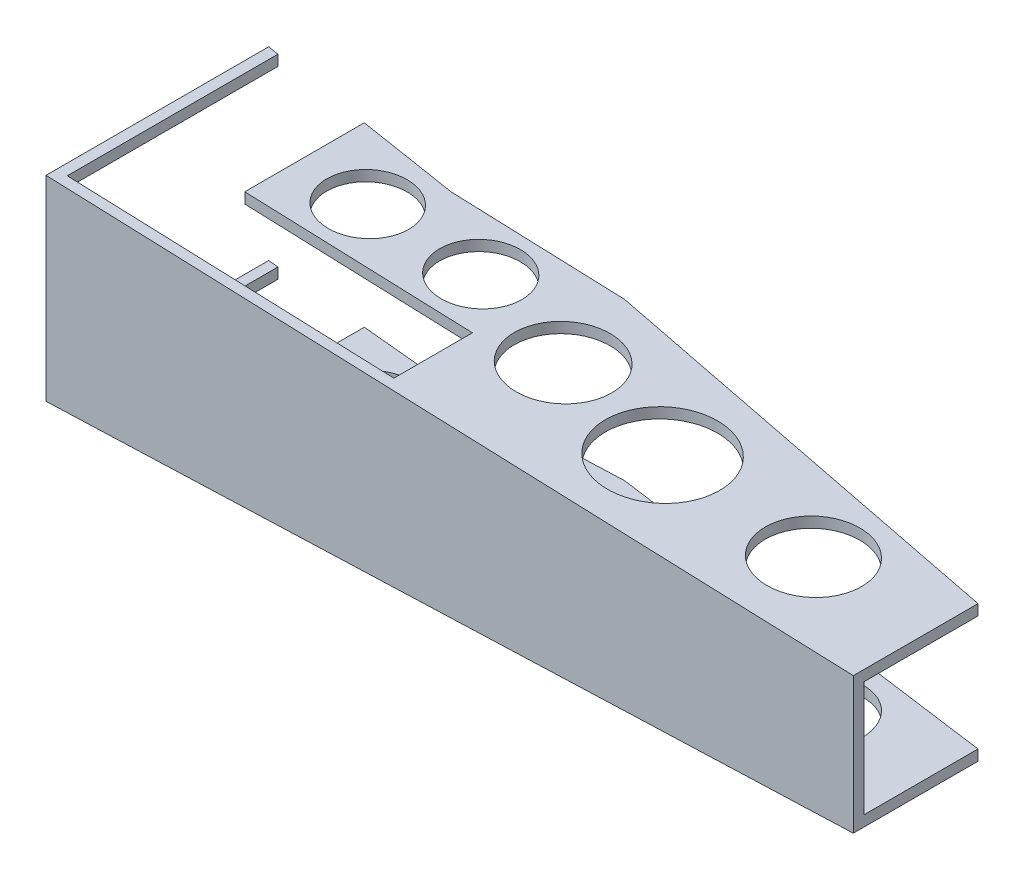
ISO-10303-21;
HEADER;
FILE_DESCRIPTION(('STEP AP214'),'2;1');
FILE_NAME('part.step','',(''),(''),'','','');
FILE_SCHEMA(('AUTOMOTIVE_DESIGN { 1 0 10303 214 1 1 1 1 }'));
ENDSEC;
DATA;
#1=APPLICATION_CONTEXT('core data for automotive mechanical design processes');
#2=APPLICATION_PROTOCOL_DEFINITION('international standard','automotive_design',2000,#1);
#3=PRODUCT_CONTEXT('',#1,'mechanical');
#4=PRODUCT('Part','Part','',(#3));
#5=PRODUCT_RELATED_PRODUCT_CATEGORY('part','',(#4));
#6=PRODUCT_DEFINITION_FORMATION('','',#4);
#7=PRODUCT_DEFINITION_CONTEXT('part definition',#1,'design');
#8=PRODUCT_DEFINITION('design','',#6,#7);
#9=PRODUCT_DEFINITION_SHAPE('','',#8);
#10=(LENGTH_UNIT() NAMED_UNIT(*) SI_UNIT(.MILLI.,.METRE.));
#11=(NAMED_UNIT(*) PLANE_ANGLE_UNIT() SI_UNIT($,.RADIAN.));
#12=(NAMED_UNIT(*) SI_UNIT($,.STERADIAN.) SOLID_ANGLE_UNIT());
#13=UNCERTAINTY_MEASURE_WITH_UNIT(LENGTH_MEASURE(1.E-05),#10,'distance_accuracy_value','');
#14=(GEOMETRIC_REPRESENTATION_CONTEXT(3) GLOBAL_UNCERTAINTY_ASSIGNED_CONTEXT((#13)) GLOBAL_UNIT_ASSIGNED_CONTEXT((#10,
#11,#12)) REPRESENTATION_CONTEXT('',''));
#15=CARTESIAN_POINT('',(0.,0.,0.));
#16=DIRECTION('',(0.,0.,1.));
#17=DIRECTION('',(1.,0.,0.));
#18=AXIS2_PLACEMENT_3D('',#15,#16,#17);
#19=CARTESIAN_POINT('',(0.,105.1,15.));
#20=DIRECTION('',(0.126715247143414,0.,-0.991939134292716));
#21=DIRECTION('',(-0.991939134292716,0.,-0.126715247143414));
#22=AXIS2_PLACEMENT_3D('',#19,#20,#21);
#23=PLANE('',#22);
#24=DIRECTION('',(0.,1.,0.));
#25=VECTOR('',#24,1.);
#26=CARTESIAN_POINT('',(4.3,105.1,15.5493034238489));
#27=LINE('',#26,#25);
#28=CARTESIAN_POINT('',(4.3,35.097258657677,15.5493034238489));
#29=VERTEX_POINT('',#28);
#30=CARTESIAN_POINT('',(4.30000000000004,39.397258657677,15.5493034238489));
#31=VERTEX_POINT('',#30);
#32=EDGE_CURVE('E273',#29,#31,#27,.T.);
#33=ORIENTED_EDGE('',*,*,#32,.F.);
#34=DIRECTION('',(-0.991283067279321,0.036364260849934,-0.126631437874407));
#35=VECTOR('',#34,1.);
#36=CARTESIAN_POINT('',(-2.51772199464138,35.3473601969839,14.6783736483823));
#37=LINE('',#36,#35);
#38=CARTESIAN_POINT('',(0.,35.255,15.));
#39=VERTEX_POINT('',#38);
#40=EDGE_CURVE('E51',#29,#39,#37,.T.);
#41=ORIENTED_EDGE('',*,*,#40,.T.);
#42=DIRECTION('',(0.,-1.,0.));
#43=VECTOR('',#42,1.);
#44=CARTESIAN_POINT('',(0.,105.1,15.));
#45=LINE('',#44,#43);
#46=CARTESIAN_POINT('',(0.,39.555,15.));
#47=VERTEX_POINT('',#46);
#48=EDGE_CURVE('E424',#47,#39,#45,.T.);
#49=ORIENTED_EDGE('',*,*,#48,.F.);
#50=DIRECTION('',(0.991283067279321,-0.036364260849934,0.126631437874407));
#51=VECTOR('',#50,1.);
#52=CARTESIAN_POINT('',(332.365093492241,27.3625079095859,57.4579729821257));
#53=LINE('',#52,#51);
#54=EDGE_CURVE('E416',#47,#31,#53,.T.);
#55=ORIENTED_EDGE('',*,*,#54,.T.);
#56=EDGE_LOOP('',(#33,#41,#49,#55));
#57=FACE_BOUND('',#56,.T.);
#58=ADVANCED_FACE('F47',(#57),#23,.T.);
#59=DIRECTION('',(0.,1.,0.));
#60=VECTOR('',#59,1.);
#61=CARTESIAN_POINT('',(4.3,105.1,15.5493034238489));
#62=LINE('',#61,#60);
#63=CARTESIAN_POINT('',(4.3,-39.397258657677,15.5493034238489));
#64=VERTEX_POINT('',#63);
#65=CARTESIAN_POINT('',(4.3,-35.097258657677,15.5493034238489));
#66=VERTEX_POINT('',#65);
#67=EDGE_CURVE('E268',#64,#66,#62,.T.);
#68=ORIENTED_EDGE('',*,*,#67,.F.);
#69=DIRECTION('',(-0.991283067279321,-0.036364260849934,-0.126631437874407));
#70=VECTOR('',#69,1.);
#71=CARTESIAN_POINT('',(11.297484013512,-39.14056272252,16.4431968952326));
#72=LINE('',#71,#70);
#73=CARTESIAN_POINT('',(0.,-39.555,15.));
#74=VERTEX_POINT('',#73);
#75=EDGE_CURVE('E388',#64,#74,#72,.T.);
#76=ORIENTED_EDGE('',*,*,#75,.T.);
#77=CARTESIAN_POINT('',(0.,-35.255,15.));
#78=VERTEX_POINT('',#77);
#79=EDGE_CURVE('E429',#78,#74,#45,.T.);
#80=ORIENTED_EDGE('',*,*,#79,.F.);
#81=DIRECTION('',(0.991283067279321,0.036364260849934,0.126631437874407));
#82=VECTOR('',#81,1.);
#83=CARTESIAN_POINT('',(5.05941542784582,-35.0694002369865,15.6463149342301));
#84=LINE('',#83,#82);
#85=EDGE_CURVE('E355',#78,#66,#84,.T.);
#86=ORIENTED_EDGE('',*,*,#85,.T.);
#87=EDGE_LOOP('',(#68,#76,#80,#86));
#88=FACE_BOUND('',#87,.T.);
#89=ADVANCED_FACE('F484',(#88),#23,.T.);
#90=CARTESIAN_POINT('',(1.29155751432091,35.2076204613962,0.));
#91=DIRECTION('',(-0.0366593747958907,-0.999327819206277,0.));
#92=DIRECTION('',(0.999327819206277,-0.0366593747958907,0.));
#93=AXIS2_PLACEMENT_3D('',#90,#91,#92);
#94=PLANE('',#93);
#95=DIRECTION('',(0.,0.,-1.));
#96=VECTOR('',#95,1.);
#97=CARTESIAN_POINT('',(4.3,35.097258657677,0.));
#98=LINE('',#97,#96);
#99=CARTESIAN_POINT('',(4.30000000000001,35.097258657677,100.7));
#100=VERTEX_POINT('',#99);
#101=EDGE_CURVE('E271',#100,#29,#98,.T.);
#102=ORIENTED_EDGE('',*,*,#101,.F.);
#103=DIRECTION('',(-0.999327819206278,0.0366593747958907,0.));
#104=VECTOR('',#103,1.);
#105=CARTESIAN_POINT('',(326.3,23.285,100.7));
#106=LINE('',#105,#104);
#107=CARTESIAN_POINT('',(0.,35.255,100.7));
#108=VERTEX_POINT('',#107);
#109=EDGE_CURVE('E333',#100,#108,#106,.T.);
#110=ORIENTED_EDGE('',*,*,#109,.T.);
#111=DIRECTION('',(0.,0.,-1.));
#112=VECTOR('',#111,1.);
#113=CARTESIAN_POINT('',(0.,35.255,-10.9565275072));
#114=LINE('',#113,#112);
#115=EDGE_CURVE('E493',#108,#39,#114,.T.);
#116=ORIENTED_EDGE('',*,*,#115,.T.);
#117=ORIENTED_EDGE('',*,*,#40,.F.);
#118=EDGE_LOOP('',(#102,#110,#116,#117));
#119=FACE_BOUND('',#118,.T.);
#120=ADVANCED_FACE('F556',(#119),#94,.T.);
#121=CARTESIAN_POINT('',(1.29155751432091,-35.2076204613962,0.));
#122=DIRECTION('',(-0.0366593747958907,0.999327819206278,0.));
#123=DIRECTION('',(-0.999327819206278,-0.0366593747958907,0.));
#124=AXIS2_PLACEMENT_3D('',#121,#122,#123);
#125=PLANE('',#124);
#126=DIRECTION('',(0.,0.,1.));
#127=VECTOR('',#126,1.);
#128=CARTESIAN_POINT('',(4.3,-35.097258657677,0.));
#129=LINE('',#128,#127);
#130=CARTESIAN_POINT('',(4.30000000000003,-35.097258657677,100.7));
#131=VERTEX_POINT('',#130);
#132=EDGE_CURVE('E12',#66,#131,#129,.T.);
#133=ORIENTED_EDGE('',*,*,#132,.F.);
#134=ORIENTED_EDGE('',*,*,#85,.F.);
#135=DIRECTION('',(0.,0.,1.));
#136=VECTOR('',#135,1.);
#137=CARTESIAN_POINT('',(0.,-35.255,-10.9565275072));
#138=LINE('',#137,#136);
#139=CARTESIAN_POINT('',(0.,-35.255,100.7));
#140=VERTEX_POINT('',#139);
#141=EDGE_CURVE('E480',#78,#140,#138,.T.);
#142=ORIENTED_EDGE('',*,*,#141,.T.);
#143=DIRECTION('',(-0.999327819206278,-0.0366593747958907,0.));
#144=VECTOR('',#143,1.);
#145=CARTESIAN_POINT('',(326.3,-23.285,100.7));
#146=LINE('',#145,#144);
#147=EDGE_CURVE('E332',#131,#140,#146,.T.);
#148=ORIENTED_EDGE('',*,*,#147,.F.);
#149=EDGE_LOOP('',(#133,#134,#142,#148));
#150=FACE_BOUND('',#149,.T.);
#151=ADVANCED_FACE('F490',(#150),#125,.T.);
#152=CARTESIAN_POINT('',(326.3,-27.585,105.));
#153=DIRECTION('',(-1.,0.,0.));
#154=DIRECTION('',(0.,0.,1.));
#155=AXIS2_PLACEMENT_3D('',#152,#153,#154);
#156=PLANE('',#155);
#157=DIRECTION('',(0.,0.,1.));
#158=VECTOR('',#157,1.);
#159=CARTESIAN_POINT('',(326.3,23.285,100.7));
#160=LINE('',#159,#158);
#161=CARTESIAN_POINT('',(326.3,23.285,54.6));
#162=VERTEX_POINT('',#161);
#163=CARTESIAN_POINT('',(326.3,23.285,100.7));
#164=VERTEX_POINT('',#163);
#165=EDGE_CURVE('E339',#162,#164,#160,.T.);
#166=ORIENTED_EDGE('',*,*,#165,.F.);
#167=DIRECTION('',(0.,-1.,0.));
#168=VECTOR('',#167,1.);
#169=CARTESIAN_POINT('',(326.3,105.1,54.6));
#170=LINE('',#169,#168);
#171=CARTESIAN_POINT('',(326.3,27.585,54.6));
#172=VERTEX_POINT('',#171);
#173=EDGE_CURVE('E380',#172,#162,#170,.T.);
#174=ORIENTED_EDGE('',*,*,#173,.F.);
#175=DIRECTION('',(0.,0.,-1.));
#176=VECTOR('',#175,1.);
#177=CARTESIAN_POINT('',(326.3,27.585,105.));
#178=LINE('',#177,#176);
#179=CARTESIAN_POINT('',(326.3,27.585,105.));
#180=VERTEX_POINT('',#179);
#181=EDGE_CURVE('E395',#180,#172,#178,.T.);
#182=ORIENTED_EDGE('',*,*,#181,.F.);
#183=DIRECTION('',(0.,1.,0.));
#184=VECTOR('',#183,1.);
#185=CARTESIAN_POINT('',(326.3,-27.585,105.));
#186=LINE('',#185,#184);
#187=CARTESIAN_POINT('',(326.3,-27.585,105.));
#188=VERTEX_POINT('',#187);
#189=EDGE_CURVE('E413',#188,#180,#186,.T.);
#190=ORIENTED_EDGE('',*,*,#189,.F.);
#191=DIRECTION('',(0.,0.,-1.));
#192=VECTOR('',#191,1.);
#193=CARTESIAN_POINT('',(326.3,-27.585,105.));
#194=LINE('',#193,#192);
#195=CARTESIAN_POINT('',(326.3,-27.585,54.6));
#196=VERTEX_POINT('',#195);
#197=EDGE_CURVE('E404',#188,#196,#194,.T.);
#198=ORIENTED_EDGE('',*,*,#197,.T.);
#199=CARTESIAN_POINT('',(326.3,-23.285,54.6));
#200=VERTEX_POINT('',#199);
#201=EDGE_CURVE('E368',#200,#196,#170,.T.);
#202=ORIENTED_EDGE('',*,*,#201,.F.);
#203=DIRECTION('',(0.,0.,-1.));
#204=VECTOR('',#203,1.);
#205=CARTESIAN_POINT('',(326.3,-23.285,100.7));
#206=LINE('',#205,#204);
#207=CARTESIAN_POINT('',(326.3,-23.285,100.7));
#208=VERTEX_POINT('',#207);
#209=EDGE_CURVE('E452',#208,#200,#206,.T.);
#210=ORIENTED_EDGE('',*,*,#209,.F.);
#211=DIRECTION('',(0.,-1.,0.));
#212=VECTOR('',#211,1.);
#213=CARTESIAN_POINT('',(326.3,23.285,100.7));
#214=LINE('',#213,#212);
#215=EDGE_CURVE('E328',#164,#208,#214,.T.);
#216=ORIENTED_EDGE('',*,*,#215,.F.);
#217=EDGE_LOOP('',(#166,#174,#182,#190,#198,#202,#210,#216));
#218=FACE_BOUND('',#217,.T.);
#219=ADVANCED_FACE('F49',(#218),#156,.F.);
#220=CARTESIAN_POINT('',(0.,39.555,105.));
#221=DIRECTION('',(1.,0.,0.));
#222=DIRECTION('',(0.,1.,0.));
#223=AXIS2_PLACEMENT_3D('',#220,#221,#222);
#224=PLANE('',#223);
#225=ORIENTED_EDGE('',*,*,#115,.F.);
#226=DIRECTION('',(0.,1.,0.));
#227=VECTOR('',#226,1.);
#228=CARTESIAN_POINT('',(0.,35.255,100.7));
#229=LINE('',#228,#227);
#230=EDGE_CURVE('E492',#140,#108,#229,.T.);
#231=ORIENTED_EDGE('',*,*,#230,.F.);
#232=ORIENTED_EDGE('',*,*,#141,.F.);
#233=ORIENTED_EDGE('',*,*,#79,.T.);
#234=DIRECTION('',(0.,0.,-1.));
#235=VECTOR('',#234,1.);
#236=CARTESIAN_POINT('',(0.,-39.555,105.));
#237=LINE('',#236,#235);
#238=CARTESIAN_POINT('',(0.,-39.555,105.));
#239=VERTEX_POINT('',#238);
#240=EDGE_CURVE('E401',#239,#74,#237,.T.);
#241=ORIENTED_EDGE('',*,*,#240,.F.);
#242=DIRECTION('',(0.,-1.,0.));
#243=VECTOR('',#242,1.);
#244=CARTESIAN_POINT('',(0.,39.555,105.));
#245=LINE('',#244,#243);
#246=CARTESIAN_POINT('',(0.,39.555,105.));
#247=VERTEX_POINT('',#246);
#248=EDGE_CURVE('E409',#247,#239,#245,.T.);
#249=ORIENTED_EDGE('',*,*,#248,.F.);
#250=DIRECTION('',(0.,0.,-1.));
#251=VECTOR('',#250,1.);
#252=CARTESIAN_POINT('',(0.,39.555,105.));
#253=LINE('',#252,#251);
#254=EDGE_CURVE('E398',#247,#47,#253,.T.);
#255=ORIENTED_EDGE('',*,*,#254,.T.);
#256=ORIENTED_EDGE('',*,*,#48,.T.);
#257=EDGE_LOOP('',(#225,#231,#232,#233,#241,#249,#255,#256));
#258=FACE_BOUND('',#257,.T.);
#259=ADVANCED_FACE('F476',(#258),#224,.F.);
#260=DIRECTION('',(0.,-1.,0.));
#261=VECTOR('',#260,1.);
#262=CARTESIAN_POINT('',(44.3,105.1,20.6591027154663));
#263=LINE('',#262,#261);
#264=CARTESIAN_POINT('',(44.3,37.929897333742,20.6591027154663));
#265=VERTEX_POINT('',#264);
#266=CARTESIAN_POINT('',(44.3,33.629897333742,20.6591027154664));
#267=VERTEX_POINT('',#266);
#268=EDGE_CURVE('E263',#265,#267,#263,.T.);
#269=ORIENTED_EDGE('',*,*,#268,.F.);
#270=CARTESIAN_POINT('',(84.7,36.4478623965676,25.82));
#271=VERTEX_POINT('',#270);
#272=EDGE_CURVE('E419',#265,#271,#53,.T.);
#273=ORIENTED_EDGE('',*,*,#272,.T.);
#274=DIRECTION('',(0.,-1.,0.));
#275=VECTOR('',#274,1.);
#276=CARTESIAN_POINT('',(84.7,105.1,25.82));
#277=LINE('',#276,#275);
#278=CARTESIAN_POINT('',(84.7,32.1478623965676,25.82));
#279=VERTEX_POINT('',#278);
#280=EDGE_CURVE('E426',#271,#279,#277,.T.);
#281=ORIENTED_EDGE('',*,*,#280,.T.);
#282=EDGE_CURVE('E366',#279,#267,#37,.T.);
#283=ORIENTED_EDGE('',*,*,#282,.T.);
#284=EDGE_LOOP('',(#269,#273,#281,#283));
#285=FACE_BOUND('',#284,.T.);
#286=ADVANCED_FACE('F552',(#285),#23,.T.);
#287=DIRECTION('',(0.,-1.,0.));
#288=VECTOR('',#287,1.);
#289=CARTESIAN_POINT('',(44.3,105.1,20.6591027154663));
#290=LINE('',#289,#288);
#291=CARTESIAN_POINT('',(44.3,-33.629897333742,20.6591027154664));
#292=VERTEX_POINT('',#291);
#293=CARTESIAN_POINT('',(44.3,-37.929897333742,20.6591027154663));
#294=VERTEX_POINT('',#293);
#295=EDGE_CURVE('E256',#292,#294,#290,.T.);
#296=ORIENTED_EDGE('',*,*,#295,.F.);
#297=CARTESIAN_POINT('',(84.7,-32.1478623965676,25.82));
#298=VERTEX_POINT('',#297);
#299=EDGE_CURVE('E352',#292,#298,#84,.T.);
#300=ORIENTED_EDGE('',*,*,#299,.T.);
#301=CARTESIAN_POINT('',(84.7,-36.4478623965676,25.82));
#302=VERTEX_POINT('',#301);
#303=EDGE_CURVE('E462',#298,#302,#277,.T.);
#304=ORIENTED_EDGE('',*,*,#303,.T.);
#305=EDGE_CURVE('E384',#302,#294,#72,.T.);
#306=ORIENTED_EDGE('',*,*,#305,.T.);
#307=EDGE_LOOP('',(#296,#300,#304,#306));
#308=FACE_BOUND('',#307,.T.);
#309=ADVANCED_FACE('F557',(#308),#23,.T.);
#310=CARTESIAN_POINT('',(84.7,105.1,25.82));
#311=DIRECTION('',(0.,0.,-1.));
#312=DIRECTION('',(-1.,0.,0.));
#313=AXIS2_PLACEMENT_3D('',#310,#311,#312);
#314=PLANE('',#313);
#315=DIRECTION('',(0.,-1.,0.));
#316=VECTOR('',#315,1.);
#317=CARTESIAN_POINT('',(154.7,105.1,25.82));
#318=LINE('',#317,#316);
#319=CARTESIAN_POINT('',(154.7,33.8799800796813,25.82));
#320=VERTEX_POINT('',#319);
#321=CARTESIAN_POINT('',(154.7,29.5799800796813,25.82));
#322=VERTEX_POINT('',#321);
#323=EDGE_CURVE('E374',#320,#322,#318,.T.);
#324=ORIENTED_EDGE('',*,*,#323,.T.);
#325=DIRECTION('',(-0.999327819206277,0.0366593747958907,0.));
#326=VECTOR('',#325,1.);
#327=CARTESIAN_POINT('',(82.0274179121405,32.2459034863367,25.82));
#328=LINE('',#327,#326);
#329=EDGE_CURVE('E362',#322,#279,#328,.T.);
#330=ORIENTED_EDGE('',*,*,#329,.T.);
#331=ORIENTED_EDGE('',*,*,#280,.F.);
#332=DIRECTION('',(0.999327819206278,-0.0366593747958907,0.));
#333=VECTOR('',#332,1.);
#334=CARTESIAN_POINT('',(326.3,27.585,25.82));
#335=LINE('',#334,#333);
#336=EDGE_CURVE('E420',#271,#320,#335,.T.);
#337=ORIENTED_EDGE('',*,*,#336,.T.);
#338=EDGE_LOOP('',(#324,#330,#331,#337));
#339=FACE_BOUND('',#338,.T.);
#340=ADVANCED_FACE('F565',(#339),#314,.T.);
#341=ORIENTED_EDGE('',*,*,#303,.F.);
#342=DIRECTION('',(0.999327819206278,0.0366593747958907,0.));
#343=VECTOR('',#342,1.);
#344=CARTESIAN_POINT('',(89.7280388030852,-31.9634136546953,25.82));
#345=LINE('',#344,#343);
#346=CARTESIAN_POINT('',(154.7,-29.5799800796813,25.82));
#347=VERTEX_POINT('',#346);
#348=EDGE_CURVE('E356',#298,#347,#345,.T.);
#349=ORIENTED_EDGE('',*,*,#348,.T.);
#350=CARTESIAN_POINT('',(154.7,-33.8799800796813,25.82));
#351=VERTEX_POINT('',#350);
#352=EDGE_CURVE('E383',#347,#351,#318,.T.);
#353=ORIENTED_EDGE('',*,*,#352,.T.);
#354=DIRECTION('',(-0.999327819206278,-0.0366593747958907,0.));
#355=VECTOR('',#354,1.);
#356=CARTESIAN_POINT('',(0.,-39.555,25.82));
#357=LINE('',#356,#355);
#358=EDGE_CURVE('E389',#351,#302,#357,.T.);
#359=ORIENTED_EDGE('',*,*,#358,.T.);
#360=EDGE_LOOP('',(#341,#349,#353,#359));
#361=FACE_BOUND('',#360,.T.);
#362=ADVANCED_FACE('F461',(#361),#314,.T.);
#363=CARTESIAN_POINT('',(154.7,105.1,25.82));
#364=DIRECTION('',(0.165405444621505,0.,-0.986225653128919));
#365=DIRECTION('',(-0.986225653128919,0.,-0.165405444621505));
#366=AXIS2_PLACEMENT_3D('',#363,#364,#365);
#367=PLANE('',#366);
#368=ORIENTED_EDGE('',*,*,#173,.T.);
#369=DIRECTION('',(-0.985580850259129,0.0361550805320312,-0.165297301109894));
#370=VECTOR('',#369,1.);
#371=CARTESIAN_POINT('',(152.008938111662,29.6786990830628,25.3686668930864));
#372=LINE('',#371,#370);
#373=EDGE_CURVE('E351',#162,#322,#372,.T.);
#374=ORIENTED_EDGE('',*,*,#373,.T.);
#375=ORIENTED_EDGE('',*,*,#323,.F.);
#376=DIRECTION('',(0.985580850259129,-0.0361550805320312,0.165297301109894));
#377=VECTOR('',#376,1.);
#378=CARTESIAN_POINT('',(334.510858270501,27.2837926034389,55.9770891668124));
#379=LINE('',#378,#377);
#380=EDGE_CURVE('E422',#320,#172,#379,.T.);
#381=ORIENTED_EDGE('',*,*,#380,.T.);
#382=EDGE_LOOP('',(#368,#374,#375,#381));
#383=FACE_BOUND('',#382,.T.);
#384=ADVANCED_FACE('F574',(#383),#367,.T.);
#385=ORIENTED_EDGE('',*,*,#352,.F.);
#386=DIRECTION('',(0.985580850259129,0.0361550805320312,0.165297301109894));
#387=VECTOR('',#386,1.);
#388=CARTESIAN_POINT('',(159.499153415173,-29.4039277769549,26.6248929795378));
#389=LINE('',#388,#387);
#390=EDGE_CURVE('E387',#347,#200,#389,.T.);
#391=ORIENTED_EDGE('',*,*,#390,.T.);
#392=ORIENTED_EDGE('',*,*,#201,.T.);
#393=DIRECTION('',(-0.985580850259129,-0.0361550805320312,-0.165297301109894));
#394=VECTOR('',#393,1.);
#395=CARTESIAN_POINT('',(17.1264176977011,-38.9267339263209,2.74676166281956));
#396=LINE('',#395,#394);
#397=EDGE_CURVE('E392',#196,#351,#396,.T.);
#398=ORIENTED_EDGE('',*,*,#397,.T.);
#399=EDGE_LOOP('',(#385,#391,#392,#398));
#400=FACE_BOUND('',#399,.T.);
#401=ADVANCED_FACE('F443',(#400),#367,.T.);
#402=CARTESIAN_POINT('',(326.3,27.585,105.));
#403=DIRECTION('',(-0.0366593747958907,-0.999327819206278,0.));
#404=DIRECTION('',(0.999327819206278,-0.0366593747958907,0.));
#405=AXIS2_PLACEMENT_3D('',#402,#403,#404);
#406=PLANE('',#405);
#407=CARTESIAN_POINT('',(164.053366888839,33.5368608591499,60.0411514203407));
#408=DIRECTION('',(-0.0366593747958907,-0.999327819206278,0.));
#409=DIRECTION('',(-0.999327819206278,0.0366593747958907,0.));
#410=AXIS2_PLACEMENT_3D('',#407,#408,#409);
#411=ELLIPSE('',#410,19.7122460472801,19.6989958540859);
#412=CARTESIAN_POINT('',(144.354371034753,34.2594994750659,60.0411514203407));
#413=VERTEX_POINT('',#412);
#414=EDGE_CURVE('E305',#413,#413,#411,.T.);
#415=ORIENTED_EDGE('',*,*,#414,.T.);
#416=EDGE_LOOP('',(#415));
#417=FACE_BOUND('',#416,.T.);
#418=CARTESIAN_POINT('',(72.4261538780614,36.8981165739491,47.3940149765995));
#419=DIRECTION('',(-0.0366593747958907,-0.999327819206278,0.));
#420=DIRECTION('',(-0.999327819206278,0.0366593747958907,0.));
#421=AXIS2_PLACEMENT_3D('',#418,#419,#420);
#422=ELLIPSE('',#421,16.5318375290395,16.5207251453675);
#423=CARTESIAN_POINT('',(55.9054287326938,37.504163401991,47.3940149765995));
#424=VERTEX_POINT('',#423);
#425=EDGE_CURVE('E295',#424,#424,#422,.T.);
#426=ORIENTED_EDGE('',*,*,#425,.T.);
#427=EDGE_LOOP('',(#426));
#428=FACE_BOUND('',#427,.T.);
#429=CARTESIAN_POINT('',(118.110707970759,35.2222228795281,47.3940149765995));
#430=DIRECTION('',(-0.0366593747958907,-0.999327819206278,0.));
#431=DIRECTION('',(-0.999327819206278,0.0366593747958907,0.));
#432=AXIS2_PLACEMENT_3D('',#429,#430,#431);
#433=ELLIPSE('',#432,16.6283981216021,16.6172208317544);
#434=CARTESIAN_POINT('',(101.493487139004,35.8318095585232,47.3940149765995));
#435=VERTEX_POINT('',#434);
#436=EDGE_CURVE('E285',#435,#435,#433,.T.);
#437=ORIENTED_EDGE('',*,*,#436,.T.);
#438=EDGE_LOOP('',(#437));
#439=FACE_BOUND('',#438,.T.);
#440=CARTESIAN_POINT('',(214.641912663803,31.6810689715424,70.4404174932141));
#441=DIRECTION('',(-0.0366593747958907,-0.999327819206278,0.));
#442=DIRECTION('',(-0.999327819206278,0.0366593747958907,0.));
#443=AXIS2_PLACEMENT_3D('',#440,#441,#442);
#444=ELLIPSE('',#443,23.1082706535431,23.0927377178336);
#445=CARTESIAN_POINT('',(191.549174945969,32.5282037263155,70.4404174932141));
#446=VERTEX_POINT('',#445);
#447=EDGE_CURVE('E325',#446,#446,#444,.T.);
#448=ORIENTED_EDGE('',*,*,#447,.T.);
#449=EDGE_LOOP('',(#448));
#450=FACE_BOUND('',#449,.T.);
#451=CARTESIAN_POINT('',(278.393804533274,29.3423924601187,73.2044975148467));
#452=DIRECTION('',(-0.0366593747958907,-0.999327819206278,0.));
#453=DIRECTION('',(-0.999327819206278,0.0366593747958907,0.));
#454=AXIS2_PLACEMENT_3D('',#451,#452,#453);
#455=ELLIPSE('',#454,19.4722071544786,19.4591183108179);
#456=CARTESIAN_POINT('',(258.934686222456,30.0562314002979,73.2044975148467));
#457=VERTEX_POINT('',#456);
#458=EDGE_CURVE('E315',#457,#457,#455,.T.);
#459=ORIENTED_EDGE('',*,*,#458,.T.);
#460=EDGE_LOOP('',(#459));
#461=FACE_BOUND('',#460,.T.);
#462=DIRECTION('',(-0.999327819206278,0.0366593747958907,0.));
#463=VECTOR('',#462,1.);
#464=CARTESIAN_POINT('',(326.3,27.585,100.7));
#465=LINE('',#464,#463);
#466=CARTESIAN_POINT('',(136.3,34.5549662886914,100.7));
#467=VERTEX_POINT('',#466);
#468=CARTESIAN_POINT('',(4.30000000000002,39.397258657677,100.7));
#469=VERTEX_POINT('',#468);
#470=EDGE_CURVE('E235',#467,#469,#465,.T.);
#471=ORIENTED_EDGE('',*,*,#470,.T.);
#472=DIRECTION('',(0.,0.,-1.));
#473=VECTOR('',#472,1.);
#474=CARTESIAN_POINT('',(4.30000000000003,39.397258657677,105.));
#475=LINE('',#474,#473);
#476=EDGE_CURVE('E275',#469,#31,#475,.T.);
#477=ORIENTED_EDGE('',*,*,#476,.T.);
#478=ORIENTED_EDGE('',*,*,#54,.F.);
#479=ORIENTED_EDGE('',*,*,#254,.F.);
#480=DIRECTION('',(-0.999327819206278,0.0366593747958907,0.));
#481=VECTOR('',#480,1.);
#482=CARTESIAN_POINT('',(326.3,27.585,105.));
#483=LINE('',#482,#481);
#484=EDGE_CURVE('E411',#180,#247,#483,.T.);
#485=ORIENTED_EDGE('',*,*,#484,.F.);
#486=ORIENTED_EDGE('',*,*,#181,.T.);
#487=ORIENTED_EDGE('',*,*,#380,.F.);
#488=ORIENTED_EDGE('',*,*,#336,.F.);
#489=ORIENTED_EDGE('',*,*,#272,.F.);
#490=DIRECTION('',(0.,0.,1.));
#491=VECTOR('',#490,1.);
#492=CARTESIAN_POINT('',(44.3,37.929897333742,105.));
#493=LINE('',#492,#491);
#494=CARTESIAN_POINT('',(44.3,37.929897333742,68.95));
#495=VERTEX_POINT('',#494);
#496=EDGE_CURVE('E265',#265,#495,#493,.T.);
#497=ORIENTED_EDGE('',*,*,#496,.T.);
#498=DIRECTION('',(0.999327819206278,-0.0366593747958907,0.));
#499=VECTOR('',#498,1.);
#500=CARTESIAN_POINT('',(326.3,27.585,68.95));
#501=LINE('',#500,#499);
#502=CARTESIAN_POINT('',(136.3,34.5549662886914,68.95));
#503=VERTEX_POINT('',#502);
#504=EDGE_CURVE('E253',#495,#503,#501,.T.);
#505=ORIENTED_EDGE('',*,*,#504,.T.);
#506=DIRECTION('',(0.,0.,1.));
#507=VECTOR('',#506,1.);
#508=CARTESIAN_POINT('',(136.3,34.5549662886914,105.));
#509=LINE('',#508,#507);
#510=EDGE_CURVE('E220',#503,#467,#509,.T.);
#511=ORIENTED_EDGE('',*,*,#510,.T.);
#512=EDGE_LOOP('',(#471,#477,#478,#479,#485,#486,#487,#488,#489,#497,#505,#511));
#513=FACE_BOUND('',#512,.T.);
#514=ADVANCED_FACE('F536',(#417,#428,#439,#450,#461,#513),#406,.F.);
#515=CARTESIAN_POINT('',(0.,-39.555,105.));
#516=DIRECTION('',(-0.0366593747958907,0.999327819206278,0.));
#517=DIRECTION('',(-0.999327819206278,-0.0366593747958907,0.));
#518=AXIS2_PLACEMENT_3D('',#515,#516,#517);
#519=PLANE('',#518);
#520=CARTESIAN_POINT('',(164.053366888839,-33.5368608591499,60.0411514203407));
#521=DIRECTION('',(-0.0366593747958907,0.999327819206278,0.));
#522=DIRECTION('',(0.999327819206278,0.0366593747958907,0.));
#523=AXIS2_PLACEMENT_3D('',#520,#521,#522);
#524=ELLIPSE('',#523,19.7122460472801,19.6989958540859);
#525=CARTESIAN_POINT('',(183.752362742925,-32.8142222432338,60.0411514203407));
#526=VERTEX_POINT('',#525);
#527=EDGE_CURVE('E302',#526,#526,#524,.T.);
#528=ORIENTED_EDGE('',*,*,#527,.T.);
#529=EDGE_LOOP('',(#528));
#530=FACE_BOUND('',#529,.T.);
#531=CARTESIAN_POINT('',(72.4261538780614,-36.8981165739491,47.3940149765995));
#532=DIRECTION('',(-0.0366593747958907,0.999327819206278,0.));
#533=DIRECTION('',(0.999327819206278,0.0366593747958907,0.));
#534=AXIS2_PLACEMENT_3D('',#531,#532,#533);
#535=ELLIPSE('',#534,16.5318375290395,16.5207251453675);
#536=CARTESIAN_POINT('',(88.9468790234289,-36.2920697459073,47.3940149765995));
#537=VERTEX_POINT('',#536);
#538=EDGE_CURVE('E292',#537,#537,#535,.T.);
#539=ORIENTED_EDGE('',*,*,#538,.T.);
#540=EDGE_LOOP('',(#539));
#541=FACE_BOUND('',#540,.T.);
#542=CARTESIAN_POINT('',(118.110707970759,-35.2222228795281,47.3940149765995));
#543=DIRECTION('',(-0.0366593747958907,0.999327819206278,0.));
#544=DIRECTION('',(0.999327819206278,0.0366593747958907,0.));
#545=AXIS2_PLACEMENT_3D('',#542,#543,#544);
#546=ELLIPSE('',#545,16.6283981216021,16.6172208317544);
#547=CARTESIAN_POINT('',(134.727928802513,-34.612636200533,47.3940149765995));
#548=VERTEX_POINT('',#547);
#549=EDGE_CURVE('E282',#548,#548,#546,.T.);
#550=ORIENTED_EDGE('',*,*,#549,.T.);
#551=EDGE_LOOP('',(#550));
#552=FACE_BOUND('',#551,.T.);
#553=ORIENTED_EDGE('',*,*,#75,.F.);
#554=DIRECTION('',(0.,0.,1.));
#555=VECTOR('',#554,1.);
#556=CARTESIAN_POINT('',(4.30000000000001,-39.397258657677,105.));
#557=LINE('',#556,#555);
#558=CARTESIAN_POINT('',(4.30000000000001,-39.397258657677,100.7));
#559=VERTEX_POINT('',#558);
#560=EDGE_CURVE('E234',#64,#559,#557,.T.);
#561=ORIENTED_EDGE('',*,*,#560,.T.);
#562=DIRECTION('',(0.999327819206278,0.0366593747958907,0.));
#563=VECTOR('',#562,1.);
#564=CARTESIAN_POINT('',(0.,-39.555,100.7));
#565=LINE('',#564,#563);
#566=CARTESIAN_POINT('',(136.3,-34.5549662886914,100.7));
#567=VERTEX_POINT('',#566);
#568=EDGE_CURVE('E225',#559,#567,#565,.T.);
#569=ORIENTED_EDGE('',*,*,#568,.T.);
#570=DIRECTION('',(0.,0.,-1.));
#571=VECTOR('',#570,1.);
#572=CARTESIAN_POINT('',(136.3,-34.5549662886914,105.));
#573=LINE('',#572,#571);
#574=CARTESIAN_POINT('',(136.3,-34.5549662886914,68.95));
#575=VERTEX_POINT('',#574);
#576=EDGE_CURVE('E210',#567,#575,#573,.T.);
#577=ORIENTED_EDGE('',*,*,#576,.T.);
#578=DIRECTION('',(-0.999327819206278,-0.0366593747958907,0.));
#579=VECTOR('',#578,1.);
#580=CARTESIAN_POINT('',(0.,-39.555,68.95));
#581=LINE('',#580,#579);
#582=CARTESIAN_POINT('',(44.3,-37.929897333742,68.95));
#583=VERTEX_POINT('',#582);
#584=EDGE_CURVE('E251',#575,#583,#581,.T.);
#585=ORIENTED_EDGE('',*,*,#584,.T.);
#586=DIRECTION('',(0.,0.,-1.));
#587=VECTOR('',#586,1.);
#588=CARTESIAN_POINT('',(44.3,-37.929897333742,105.));
#589=LINE('',#588,#587);
#590=EDGE_CURVE('E258',#583,#294,#589,.T.);
#591=ORIENTED_EDGE('',*,*,#590,.T.);
#592=ORIENTED_EDGE('',*,*,#305,.F.);
#593=ORIENTED_EDGE('',*,*,#358,.F.);
#594=ORIENTED_EDGE('',*,*,#397,.F.);
#595=ORIENTED_EDGE('',*,*,#197,.F.);
#596=DIRECTION('',(0.999327819206278,0.0366593747958907,0.));
#597=VECTOR('',#596,1.);
#598=CARTESIAN_POINT('',(0.,-39.555,105.));
#599=LINE('',#598,#597);
#600=EDGE_CURVE('E407',#239,#188,#599,.T.);
#601=ORIENTED_EDGE('',*,*,#600,.F.);
#602=ORIENTED_EDGE('',*,*,#240,.T.);
#603=EDGE_LOOP('',(#553,#561,#569,#577,#585,#591,#592,#593,#594,#595,#601,#602));
#604=FACE_BOUND('',#603,.T.);
#605=CARTESIAN_POINT('',(214.641912663803,-31.6810689715424,70.4404174932141));
#606=DIRECTION('',(-0.0366593747958907,0.999327819206278,0.));
#607=DIRECTION('',(0.999327819206278,0.0366593747958907,0.));
#608=AXIS2_PLACEMENT_3D('',#605,#606,#607);
#609=ELLIPSE('',#608,23.1082706535431,23.0927377178336);
#610=CARTESIAN_POINT('',(237.734650381637,-30.8339342167693,70.4404174932141));
#611=VERTEX_POINT('',#610);
#612=EDGE_CURVE('E322',#611,#611,#609,.T.);
#613=ORIENTED_EDGE('',*,*,#612,.T.);
#614=EDGE_LOOP('',(#613));
#615=FACE_BOUND('',#614,.T.);
#616=CARTESIAN_POINT('',(278.393804533274,-29.3423924601187,73.2044975148467));
#617=DIRECTION('',(-0.0366593747958907,0.999327819206278,0.));
#618=DIRECTION('',(0.999327819206278,0.0366593747958907,0.));
#619=AXIS2_PLACEMENT_3D('',#616,#617,#618);
#620=ELLIPSE('',#619,19.4722071544786,19.4591183108179);
#621=CARTESIAN_POINT('',(297.852922844091,-28.6285535199394,73.2044975148467));
#622=VERTEX_POINT('',#621);
#623=EDGE_CURVE('E312',#622,#622,#620,.T.);
#624=ORIENTED_EDGE('',*,*,#623,.T.);
#625=EDGE_LOOP('',(#624));
#626=FACE_BOUND('',#625,.T.);
#627=ADVANCED_FACE('F232',(#530,#541,#552,#604,#615,#626),#519,.F.);
#628=CARTESIAN_POINT('',(0.,0.,105.));
#629=DIRECTION('',(0.,0.,1.));
#630=DIRECTION('',(1.,0.,0.));
#631=AXIS2_PLACEMENT_3D('',#628,#629,#630);
#632=PLANE('',#631);
#633=ORIENTED_EDGE('',*,*,#189,.T.);
#634=ORIENTED_EDGE('',*,*,#484,.T.);
#635=ORIENTED_EDGE('',*,*,#248,.T.);
#636=ORIENTED_EDGE('',*,*,#600,.T.);
#637=EDGE_LOOP('',(#633,#634,#635,#636));
#638=FACE_BOUND('',#637,.T.);
#639=ADVANCED_FACE('F535',(#638),#632,.T.);
#640=CARTESIAN_POINT('',(164.053366888839,29.2368608591499,60.0411514203407));
#641=DIRECTION('',(-0.0366593747958907,-0.999327819206277,0.));
#642=DIRECTION('',(-0.999327819206277,0.0366593747958907,0.));
#643=AXIS2_PLACEMENT_3D('',#640,#641,#642);
#644=ELLIPSE('',#643,19.7122460472801,19.6989958540859);
#645=CARTESIAN_POINT('',(144.354371034753,29.9594994750659,60.0411514203407));
#646=VERTEX_POINT('',#645);
#647=EDGE_CURVE('E299',#646,#646,#644,.T.);
#648=ORIENTED_EDGE('',*,*,#647,.F.);
#649=EDGE_LOOP('',(#648));
#650=FACE_BOUND('',#649,.T.);
#651=CARTESIAN_POINT('',(72.4261538780614,32.5981165739491,47.3940149765995));
#652=DIRECTION('',(-0.0366593747958907,-0.999327819206277,0.));
#653=DIRECTION('',(-0.999327819206277,0.0366593747958907,0.));
#654=AXIS2_PLACEMENT_3D('',#651,#652,#653);
#655=ELLIPSE('',#654,16.5318375290395,16.5207251453675);
#656=CARTESIAN_POINT('',(55.9054287326938,33.204163401991,47.3940149765995));
#657=VERTEX_POINT('',#656);
#658=EDGE_CURVE('E289',#657,#657,#655,.T.);
#659=ORIENTED_EDGE('',*,*,#658,.F.);
#660=EDGE_LOOP('',(#659));
#661=FACE_BOUND('',#660,.T.);
#662=CARTESIAN_POINT('',(118.110707970759,30.9222228795281,47.3940149765995));
#663=DIRECTION('',(-0.0366593747958907,-0.999327819206277,0.));
#664=DIRECTION('',(-0.999327819206277,0.0366593747958907,0.));
#665=AXIS2_PLACEMENT_3D('',#662,#663,#664);
#666=ELLIPSE('',#665,16.6283981216021,16.6172208317544);
#667=CARTESIAN_POINT('',(101.493487139004,31.5318095585232,47.3940149765995));
#668=VERTEX_POINT('',#667);
#669=EDGE_CURVE('E279',#668,#668,#666,.T.);
#670=ORIENTED_EDGE('',*,*,#669,.F.);
#671=EDGE_LOOP('',(#670));
#672=FACE_BOUND('',#671,.T.);
#673=DIRECTION('',(0.,0.,1.));
#674=VECTOR('',#673,1.);
#675=CARTESIAN_POINT('',(44.3,33.629897333742,0.));
#676=LINE('',#675,#674);
#677=CARTESIAN_POINT('',(44.3,33.629897333742,68.95));
#678=VERTEX_POINT('',#677);
#679=EDGE_CURVE('E261',#267,#678,#676,.T.);
#680=ORIENTED_EDGE('',*,*,#679,.F.);
#681=ORIENTED_EDGE('',*,*,#282,.F.);
#682=ORIENTED_EDGE('',*,*,#329,.F.);
#683=ORIENTED_EDGE('',*,*,#373,.F.);
#684=ORIENTED_EDGE('',*,*,#165,.T.);
#685=CARTESIAN_POINT('',(136.3,30.2549662886914,100.7));
#686=VERTEX_POINT('',#685);
#687=EDGE_CURVE('E329',#164,#686,#106,.T.);
#688=ORIENTED_EDGE('',*,*,#687,.T.);
#689=DIRECTION('',(0.,0.,1.));
#690=VECTOR('',#689,1.);
#691=CARTESIAN_POINT('',(136.3,30.2549662886914,0.));
#692=LINE('',#691,#690);
#693=CARTESIAN_POINT('',(136.3,30.2549662886914,68.95));
#694=VERTEX_POINT('',#693);
#695=EDGE_CURVE('E221',#694,#686,#692,.T.);
#696=ORIENTED_EDGE('',*,*,#695,.F.);
#697=DIRECTION('',(0.999327819206277,-0.0366593747958907,0.));
#698=VECTOR('',#697,1.);
#699=CARTESIAN_POINT('',(1.29155751432091,35.2076204613962,68.95));
#700=LINE('',#699,#698);
#701=EDGE_CURVE('E249',#678,#694,#700,.T.);
#702=ORIENTED_EDGE('',*,*,#701,.F.);
#703=EDGE_LOOP('',(#680,#681,#682,#683,#684,#688,#696,#702));
#704=FACE_BOUND('',#703,.T.);
#705=CARTESIAN_POINT('',(214.641912663803,27.3810689715424,70.4404174932141));
#706=DIRECTION('',(-0.0366593747958907,-0.999327819206277,0.));
#707=DIRECTION('',(-0.999327819206277,0.0366593747958907,0.));
#708=AXIS2_PLACEMENT_3D('',#705,#706,#707);
#709=ELLIPSE('',#708,23.1082706535431,23.0927377178336);
#710=CARTESIAN_POINT('',(191.549174945969,28.2282037263155,70.4404174932141));
#711=VERTEX_POINT('',#710);
#712=EDGE_CURVE('E319',#711,#711,#709,.T.);
#713=ORIENTED_EDGE('',*,*,#712,.F.);
#714=EDGE_LOOP('',(#713));
#715=FACE_BOUND('',#714,.T.);
#716=CARTESIAN_POINT('',(278.393804533274,25.0423924601186,73.2044975148467));
#717=DIRECTION('',(-0.0366593747958907,-0.999327819206277,0.));
#718=DIRECTION('',(-0.999327819206277,0.0366593747958907,0.));
#719=AXIS2_PLACEMENT_3D('',#716,#717,#718);
#720=ELLIPSE('',#719,19.4722071544786,19.4591183108179);
#721=CARTESIAN_POINT('',(258.934686222456,25.7562314002979,73.2044975148467));
#722=VERTEX_POINT('',#721);
#723=EDGE_CURVE('E309',#722,#722,#720,.T.);
#724=ORIENTED_EDGE('',*,*,#723,.F.);
#725=EDGE_LOOP('',(#724));
#726=FACE_BOUND('',#725,.T.);
#727=ADVANCED_FACE('F543',(#650,#661,#672,#704,#715,#726),#94,.T.);
#728=CARTESIAN_POINT('',(0.,0.,100.7));
#729=DIRECTION('',(0.,0.,-1.));
#730=DIRECTION('',(0.,1.,0.));
#731=AXIS2_PLACEMENT_3D('',#728,#729,#730);
#732=PLANE('',#731);
#733=CARTESIAN_POINT('',(136.3,-30.2549662886914,100.7));
#734=VERTEX_POINT('',#733);
#735=EDGE_CURVE('E227',#208,#734,#146,.T.);
#736=ORIENTED_EDGE('',*,*,#735,.T.);
#737=DIRECTION('',(0.,1.,0.));
#738=VECTOR('',#737,1.);
#739=CARTESIAN_POINT('',(136.3,-39.555025,100.7));
#740=LINE('',#739,#738);
#741=EDGE_CURVE('E213',#567,#734,#740,.T.);
#742=ORIENTED_EDGE('',*,*,#741,.F.);
#743=ORIENTED_EDGE('',*,*,#568,.F.);
#744=DIRECTION('',(0.,1.,0.));
#745=VECTOR('',#744,1.);
#746=CARTESIAN_POINT('',(4.30000000000001,-39.555025,100.7));
#747=LINE('',#746,#745);
#748=EDGE_CURVE('E72',#559,#131,#747,.T.);
#749=ORIENTED_EDGE('',*,*,#748,.T.);
#750=ORIENTED_EDGE('',*,*,#147,.T.);
#751=ORIENTED_EDGE('',*,*,#230,.T.);
#752=ORIENTED_EDGE('',*,*,#109,.F.);
#753=EDGE_CURVE('E244',#100,#469,#747,.T.);
#754=ORIENTED_EDGE('',*,*,#753,.T.);
#755=ORIENTED_EDGE('',*,*,#470,.F.);
#756=EDGE_CURVE('E65',#686,#467,#740,.T.);
#757=ORIENTED_EDGE('',*,*,#756,.F.);
#758=ORIENTED_EDGE('',*,*,#687,.F.);
#759=ORIENTED_EDGE('',*,*,#215,.T.);
#760=EDGE_LOOP('',(#736,#742,#743,#749,#750,#751,#752,#754,#755,#757,#758,#759));
#761=FACE_BOUND('',#760,.T.);
#762=ADVANCED_FACE('F224',(#761),#732,.T.);
#763=CARTESIAN_POINT('',(164.053366888839,-29.2368608591499,60.0411514203407));
#764=DIRECTION('',(-0.0366593747958907,0.999327819206278,0.));
#765=DIRECTION('',(0.999327819206278,0.0366593747958907,0.));
#766=AXIS2_PLACEMENT_3D('',#763,#764,#765);
#767=ELLIPSE('',#766,19.7122460472801,19.6989958540859);
#768=CARTESIAN_POINT('',(183.752362742925,-28.5142222432338,60.0411514203407));
#769=VERTEX_POINT('',#768);
#770=EDGE_CURVE('E298',#769,#769,#767,.T.);
#771=ORIENTED_EDGE('',*,*,#770,.F.);
#772=EDGE_LOOP('',(#771));
#773=FACE_BOUND('',#772,.T.);
#774=CARTESIAN_POINT('',(72.4261538780614,-32.5981165739492,47.3940149765995));
#775=DIRECTION('',(-0.0366593747958907,0.999327819206278,0.));
#776=DIRECTION('',(0.999327819206278,0.0366593747958907,0.));
#777=AXIS2_PLACEMENT_3D('',#774,#775,#776);
#778=ELLIPSE('',#777,16.5318375290395,16.5207251453675);
#779=CARTESIAN_POINT('',(88.9468790234289,-31.9920697459073,47.3940149765995));
#780=VERTEX_POINT('',#779);
#781=EDGE_CURVE('E288',#780,#780,#778,.T.);
#782=ORIENTED_EDGE('',*,*,#781,.F.);
#783=EDGE_LOOP('',(#782));
#784=FACE_BOUND('',#783,.T.);
#785=CARTESIAN_POINT('',(118.110707970759,-30.9222228795281,47.3940149765995));
#786=DIRECTION('',(-0.0366593747958907,0.999327819206278,0.));
#787=DIRECTION('',(0.999327819206278,0.0366593747958907,0.));
#788=AXIS2_PLACEMENT_3D('',#785,#786,#787);
#789=ELLIPSE('',#788,16.6283981216021,16.6172208317544);
#790=CARTESIAN_POINT('',(134.727928802513,-30.312636200533,47.3940149765995));
#791=VERTEX_POINT('',#790);
#792=EDGE_CURVE('E278',#791,#791,#789,.T.);
#793=ORIENTED_EDGE('',*,*,#792,.F.);
#794=EDGE_LOOP('',(#793));
#795=FACE_BOUND('',#794,.T.);
#796=DIRECTION('',(0.,0.,-1.));
#797=VECTOR('',#796,1.);
#798=CARTESIAN_POINT('',(44.3,-33.629897333742,0.));
#799=LINE('',#798,#797);
#800=CARTESIAN_POINT('',(44.3,-33.629897333742,68.95));
#801=VERTEX_POINT('',#800);
#802=EDGE_CURVE('E57',#801,#292,#799,.T.);
#803=ORIENTED_EDGE('',*,*,#802,.F.);
#804=DIRECTION('',(-0.999327819206278,-0.0366593747958907,0.));
#805=VECTOR('',#804,1.);
#806=CARTESIAN_POINT('',(1.29155751432091,-35.2076204613962,68.95));
#807=LINE('',#806,#805);
#808=CARTESIAN_POINT('',(136.3,-30.2549662886914,68.95));
#809=VERTEX_POINT('',#808);
#810=EDGE_CURVE('E347',#809,#801,#807,.T.);
#811=ORIENTED_EDGE('',*,*,#810,.F.);
#812=DIRECTION('',(0.,0.,-1.));
#813=VECTOR('',#812,1.);
#814=CARTESIAN_POINT('',(136.3,-30.2549662886914,0.));
#815=LINE('',#814,#813);
#816=EDGE_CURVE('E349',#734,#809,#815,.T.);
#817=ORIENTED_EDGE('',*,*,#816,.F.);
#818=ORIENTED_EDGE('',*,*,#735,.F.);
#819=ORIENTED_EDGE('',*,*,#209,.T.);
#820=ORIENTED_EDGE('',*,*,#390,.F.);
#821=ORIENTED_EDGE('',*,*,#348,.F.);
#822=ORIENTED_EDGE('',*,*,#299,.F.);
#823=EDGE_LOOP('',(#803,#811,#817,#818,#819,#820,#821,#822));
#824=FACE_BOUND('',#823,.T.);
#825=CARTESIAN_POINT('',(214.641912663803,-27.3810689715424,70.4404174932141));
#826=DIRECTION('',(-0.0366593747958907,0.999327819206278,0.));
#827=DIRECTION('',(0.999327819206278,0.0366593747958907,0.));
#828=AXIS2_PLACEMENT_3D('',#825,#826,#827);
#829=ELLIPSE('',#828,23.1082706535431,23.0927377178336);
#830=CARTESIAN_POINT('',(237.734650381637,-26.5339342167693,70.4404174932141));
#831=VERTEX_POINT('',#830);
#832=EDGE_CURVE('E318',#831,#831,#829,.T.);
#833=ORIENTED_EDGE('',*,*,#832,.F.);
#834=EDGE_LOOP('',(#833));
#835=FACE_BOUND('',#834,.T.);
#836=CARTESIAN_POINT('',(278.393804533274,-25.0423924601187,73.2044975148467));
#837=DIRECTION('',(-0.0366593747958907,0.999327819206278,0.));
#838=DIRECTION('',(0.999327819206278,0.0366593747958907,0.));
#839=AXIS2_PLACEMENT_3D('',#836,#837,#838);
#840=ELLIPSE('',#839,19.4722071544786,19.4591183108179);
#841=CARTESIAN_POINT('',(297.852922844091,-24.3285535199394,73.2044975148467));
#842=VERTEX_POINT('',#841);
#843=EDGE_CURVE('E308',#842,#842,#840,.T.);
#844=ORIENTED_EDGE('',*,*,#843,.F.);
#845=EDGE_LOOP('',(#844));
#846=FACE_BOUND('',#845,.T.);
#847=ADVANCED_FACE('F520',(#773,#784,#795,#824,#835,#846),#125,.T.);
#848=CARTESIAN_POINT('',(278.393804533274,-39.555025,73.2044975148467));
#849=DIRECTION('',(0.,1.,0.));
#850=DIRECTION('',(0.,0.,1.));
#851=AXIS2_PLACEMENT_3D('',#848,#849,#850);
#852=CYLINDRICAL_SURFACE('',#851,19.4591183108179);
#853=ORIENTED_EDGE('',*,*,#843,.T.);
#854=EDGE_LOOP('',(#853));
#855=FACE_BOUND('',#854,.T.);
#856=ORIENTED_EDGE('',*,*,#623,.F.);
#857=EDGE_LOOP('',(#856));
#858=FACE_BOUND('',#857,.T.);
#859=ADVANCED_FACE('F523',(#855,#858),#852,.F.);
#860=CARTESIAN_POINT('',(214.641912663803,-39.555025,70.4404174932141));
#861=DIRECTION('',(0.,1.,0.));
#862=DIRECTION('',(0.,0.,1.));
#863=AXIS2_PLACEMENT_3D('',#860,#861,#862);
#864=CYLINDRICAL_SURFACE('',#863,23.0927377178336);
#865=ORIENTED_EDGE('',*,*,#832,.T.);
#866=EDGE_LOOP('',(#865));
#867=FACE_BOUND('',#866,.T.);
#868=ORIENTED_EDGE('',*,*,#612,.F.);
#869=EDGE_LOOP('',(#868));
#870=FACE_BOUND('',#869,.T.);
#871=ADVANCED_FACE('F517',(#867,#870),#864,.F.);
#872=ORIENTED_EDGE('',*,*,#723,.T.);
#873=EDGE_LOOP('',(#872));
#874=FACE_BOUND('',#873,.T.);
#875=ORIENTED_EDGE('',*,*,#458,.F.);
#876=EDGE_LOOP('',(#875));
#877=FACE_BOUND('',#876,.T.);
#878=ADVANCED_FACE('F531',(#874,#877),#852,.F.);
#879=ORIENTED_EDGE('',*,*,#712,.T.);
#880=EDGE_LOOP('',(#879));
#881=FACE_BOUND('',#880,.T.);
#882=ORIENTED_EDGE('',*,*,#447,.F.);
#883=EDGE_LOOP('',(#882));
#884=FACE_BOUND('',#883,.T.);
#885=ADVANCED_FACE('F626',(#881,#884),#864,.F.);
#886=CARTESIAN_POINT('',(136.3,-39.555025,100.7));
#887=DIRECTION('',(1.,0.,0.));
#888=DIRECTION('',(0.,0.,-1.));
#889=AXIS2_PLACEMENT_3D('',#886,#887,#888);
#890=PLANE('',#889);
#891=ORIENTED_EDGE('',*,*,#741,.T.);
#892=ORIENTED_EDGE('',*,*,#816,.T.);
#893=DIRECTION('',(0.,1.,0.));
#894=VECTOR('',#893,1.);
#895=CARTESIAN_POINT('',(136.3,-39.555025,68.95));
#896=LINE('',#895,#894);
#897=EDGE_CURVE('E216',#575,#809,#896,.T.);
#898=ORIENTED_EDGE('',*,*,#897,.F.);
#899=ORIENTED_EDGE('',*,*,#576,.F.);
#900=EDGE_LOOP('',(#891,#892,#898,#899));
#901=FACE_BOUND('',#900,.T.);
#902=ADVANCED_FACE('F212',(#901),#890,.F.);
#903=CARTESIAN_POINT('',(44.3,-39.555025,68.95));
#904=DIRECTION('',(0.,0.,-1.));
#905=DIRECTION('',(-1.,0.,0.));
#906=AXIS2_PLACEMENT_3D('',#903,#904,#905);
#907=PLANE('',#906);
#908=ORIENTED_EDGE('',*,*,#897,.T.);
#909=ORIENTED_EDGE('',*,*,#810,.T.);
#910=DIRECTION('',(0.,1.,0.));
#911=VECTOR('',#910,1.);
#912=CARTESIAN_POINT('',(44.3,-39.555025,68.95));
#913=LINE('',#912,#911);
#914=EDGE_CURVE('E236',#583,#801,#913,.T.);
#915=ORIENTED_EDGE('',*,*,#914,.F.);
#916=ORIENTED_EDGE('',*,*,#584,.F.);
#917=EDGE_LOOP('',(#908,#909,#915,#916));
#918=FACE_BOUND('',#917,.T.);
#919=ADVANCED_FACE('F604',(#918),#907,.F.);
#920=CARTESIAN_POINT('',(44.3,-39.555025,6.49173873539795));
#921=DIRECTION('',(1.,0.,0.));
#922=DIRECTION('',(0.,0.,-1.));
#923=AXIS2_PLACEMENT_3D('',#920,#921,#922);
#924=PLANE('',#923);
#925=ORIENTED_EDGE('',*,*,#914,.T.);
#926=ORIENTED_EDGE('',*,*,#802,.T.);
#927=ORIENTED_EDGE('',*,*,#295,.T.);
#928=ORIENTED_EDGE('',*,*,#590,.F.);
#929=EDGE_LOOP('',(#925,#926,#927,#928));
#930=FACE_BOUND('',#929,.T.);
#931=ADVANCED_FACE('F598',(#930),#924,.F.);
#932=CARTESIAN_POINT('',(4.3,-39.555025,6.49173873539795));
#933=DIRECTION('',(-1.,0.,0.));
#934=DIRECTION('',(0.,0.,1.));
#935=AXIS2_PLACEMENT_3D('',#932,#933,#934);
#936=PLANE('',#935);
#937=ORIENTED_EDGE('',*,*,#67,.T.);
#938=ORIENTED_EDGE('',*,*,#132,.T.);
#939=ORIENTED_EDGE('',*,*,#748,.F.);
#940=ORIENTED_EDGE('',*,*,#560,.F.);
#941=EDGE_LOOP('',(#937,#938,#939,#940));
#942=FACE_BOUND('',#941,.T.);
#943=ADVANCED_FACE('F487',(#942),#936,.F.);
#944=CARTESIAN_POINT('',(118.110707970759,-39.555025,47.3940149765995));
#945=DIRECTION('',(0.,1.,0.));
#946=DIRECTION('',(0.,0.,1.));
#947=AXIS2_PLACEMENT_3D('',#944,#945,#946);
#948=CYLINDRICAL_SURFACE('',#947,16.6172208317544);
#949=ORIENTED_EDGE('',*,*,#792,.T.);
#950=EDGE_LOOP('',(#949));
#951=FACE_BOUND('',#950,.T.);
#952=ORIENTED_EDGE('',*,*,#549,.F.);
#953=EDGE_LOOP('',(#952));
#954=FACE_BOUND('',#953,.T.);
#955=ADVANCED_FACE('F614',(#951,#954),#948,.F.);
#956=CARTESIAN_POINT('',(72.4261538780614,-39.555025,47.3940149765995));
#957=DIRECTION('',(0.,1.,0.));
#958=DIRECTION('',(0.,0.,1.));
#959=AXIS2_PLACEMENT_3D('',#956,#957,#958);
#960=CYLINDRICAL_SURFACE('',#959,16.5207251453675);
#961=ORIENTED_EDGE('',*,*,#781,.T.);
#962=EDGE_LOOP('',(#961));
#963=FACE_BOUND('',#962,.T.);
#964=ORIENTED_EDGE('',*,*,#538,.F.);
#965=EDGE_LOOP('',(#964));
#966=FACE_BOUND('',#965,.T.);
#967=ADVANCED_FACE('F725',(#963,#966),#960,.F.);
#968=CARTESIAN_POINT('',(164.053366888839,-39.555025,60.0411514203407));
#969=DIRECTION('',(0.,1.,0.));
#970=DIRECTION('',(0.,0.,1.));
#971=AXIS2_PLACEMENT_3D('',#968,#969,#970);
#972=CYLINDRICAL_SURFACE('',#971,19.6989958540859);
#973=ORIENTED_EDGE('',*,*,#770,.T.);
#974=EDGE_LOOP('',(#973));
#975=FACE_BOUND('',#974,.T.);
#976=ORIENTED_EDGE('',*,*,#527,.F.);
#977=EDGE_LOOP('',(#976));
#978=FACE_BOUND('',#977,.T.);
#979=ADVANCED_FACE('F605',(#975,#978),#972,.F.);
#980=ORIENTED_EDGE('',*,*,#753,.F.);
#981=ORIENTED_EDGE('',*,*,#101,.T.);
#982=ORIENTED_EDGE('',*,*,#32,.T.);
#983=ORIENTED_EDGE('',*,*,#476,.F.);
#984=EDGE_LOOP('',(#980,#981,#982,#983));
#985=FACE_BOUND('',#984,.T.);
#986=ADVANCED_FACE('F596',(#985),#936,.F.);
#987=ORIENTED_EDGE('',*,*,#268,.T.);
#988=ORIENTED_EDGE('',*,*,#679,.T.);
#989=EDGE_CURVE('E241',#678,#495,#913,.T.);
#990=ORIENTED_EDGE('',*,*,#989,.T.);
#991=ORIENTED_EDGE('',*,*,#496,.F.);
#992=EDGE_LOOP('',(#987,#988,#990,#991));
#993=FACE_BOUND('',#992,.T.);
#994=ADVANCED_FACE('F594',(#993),#924,.F.);
#995=ORIENTED_EDGE('',*,*,#989,.F.);
#996=ORIENTED_EDGE('',*,*,#701,.T.);
#997=EDGE_CURVE('E228',#694,#503,#896,.T.);
#998=ORIENTED_EDGE('',*,*,#997,.T.);
#999=ORIENTED_EDGE('',*,*,#504,.F.);
#1000=EDGE_LOOP('',(#995,#996,#998,#999));
#1001=FACE_BOUND('',#1000,.T.);
#1002=ADVANCED_FACE('F593',(#1001),#907,.F.);
#1003=ORIENTED_EDGE('',*,*,#997,.F.);
#1004=ORIENTED_EDGE('',*,*,#695,.T.);
#1005=ORIENTED_EDGE('',*,*,#756,.T.);
#1006=ORIENTED_EDGE('',*,*,#510,.F.);
#1007=EDGE_LOOP('',(#1003,#1004,#1005,#1006));
#1008=FACE_BOUND('',#1007,.T.);
#1009=ADVANCED_FACE('F582',(#1008),#890,.F.);
#1010=ORIENTED_EDGE('',*,*,#669,.T.);
#1011=EDGE_LOOP('',(#1010));
#1012=FACE_BOUND('',#1011,.T.);
#1013=ORIENTED_EDGE('',*,*,#436,.F.);
#1014=EDGE_LOOP('',(#1013));
#1015=FACE_BOUND('',#1014,.T.);
#1016=ADVANCED_FACE('F629',(#1012,#1015),#948,.F.);
#1017=ORIENTED_EDGE('',*,*,#658,.T.);
#1018=EDGE_LOOP('',(#1017));
#1019=FACE_BOUND('',#1018,.T.);
#1020=ORIENTED_EDGE('',*,*,#425,.F.);
#1021=EDGE_LOOP('',(#1020));
#1022=FACE_BOUND('',#1021,.T.);
#1023=ADVANCED_FACE('F738',(#1019,#1022),#960,.F.);
#1024=ORIENTED_EDGE('',*,*,#647,.T.);
#1025=EDGE_LOOP('',(#1024));
#1026=FACE_BOUND('',#1025,.T.);
#1027=ORIENTED_EDGE('',*,*,#414,.F.);
#1028=EDGE_LOOP('',(#1027));
#1029=FACE_BOUND('',#1028,.T.);
#1030=ADVANCED_FACE('F748',(#1026,#1029),#972,.F.);
#1031=CLOSED_SHELL('',(#58,#89,#120,#151,#219,#259,#286,#309,#340,#362,#384,#401,#514,#627,#639,
#727,#762,#847,#859,#871,#878,#885,#902,#919,#931,#943,#955,#967,#979,#986,#994,#1002,#1009,
#1016,#1023,#1030));
#1032=MANIFOLD_SOLID_BREP('B2',#1031);
#1033=ADVANCED_BREP_SHAPE_REPRESENTATION('',(#18,#1032),#14);
#1034=SHAPE_DEFINITION_REPRESENTATION(#9,#1033);
ENDSEC;
END-ISO-10303-21;
